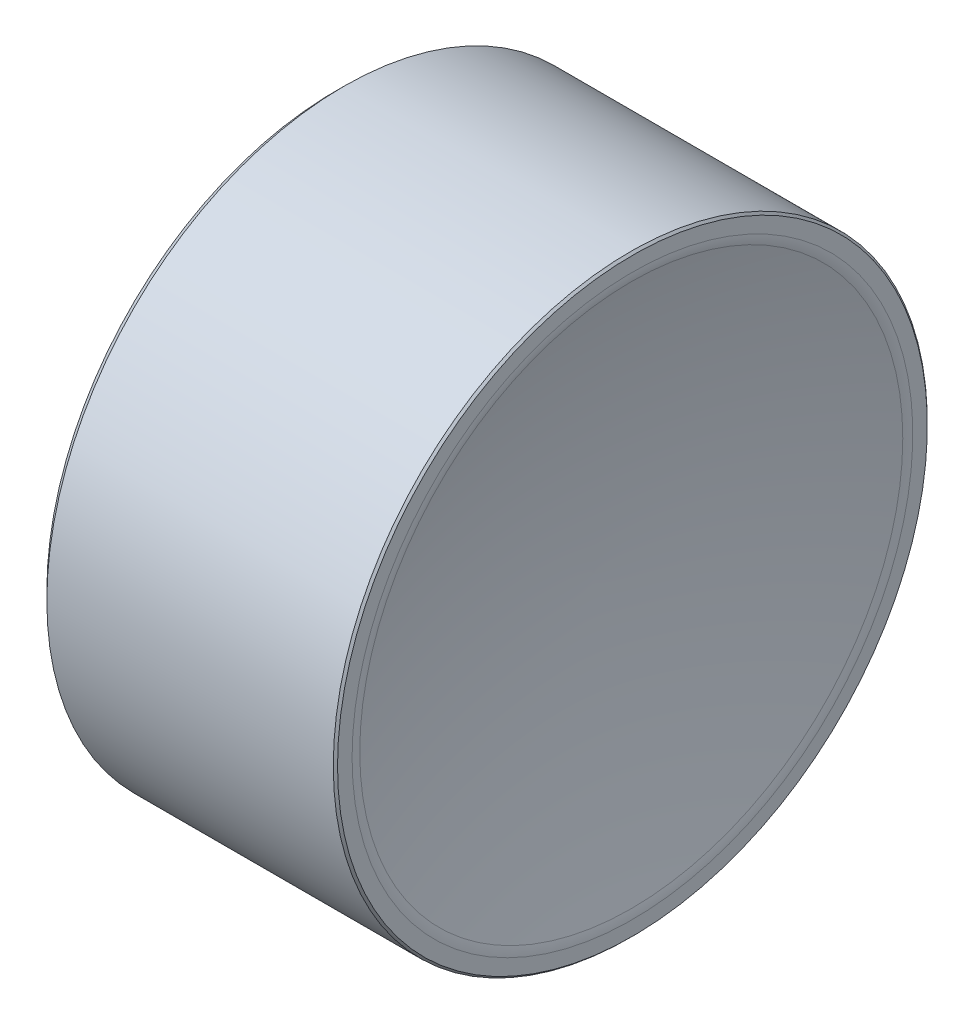
ISO-10303-21;
HEADER;
FILE_DESCRIPTION(('STEP AP214'),'2;1');
FILE_NAME('part.step','',(''),(''),'','','');
FILE_SCHEMA(('AUTOMOTIVE_DESIGN { 1 0 10303 214 1 1 1 1 }'));
ENDSEC;
DATA;
#1=APPLICATION_CONTEXT('core data for automotive mechanical design processes');
#2=APPLICATION_PROTOCOL_DEFINITION('international standard','automotive_design',2000,#1);
#3=PRODUCT_CONTEXT('',#1,'mechanical');
#4=PRODUCT('Part','Part','',(#3));
#5=PRODUCT_RELATED_PRODUCT_CATEGORY('part','',(#4));
#6=PRODUCT_DEFINITION_FORMATION('','',#4);
#7=PRODUCT_DEFINITION_CONTEXT('part definition',#1,'design');
#8=PRODUCT_DEFINITION('design','',#6,#7);
#9=PRODUCT_DEFINITION_SHAPE('','',#8);
#10=(LENGTH_UNIT() NAMED_UNIT(*) SI_UNIT(.MILLI.,.METRE.));
#11=(NAMED_UNIT(*) PLANE_ANGLE_UNIT() SI_UNIT($,.RADIAN.));
#12=(NAMED_UNIT(*) SI_UNIT($,.STERADIAN.) SOLID_ANGLE_UNIT());
#13=UNCERTAINTY_MEASURE_WITH_UNIT(LENGTH_MEASURE(1.E-05),#10,'distance_accuracy_value','');
#14=(GEOMETRIC_REPRESENTATION_CONTEXT(3) GLOBAL_UNCERTAINTY_ASSIGNED_CONTEXT((#13)) GLOBAL_UNIT_ASSIGNED_CONTEXT((#10,
#11,#12)) REPRESENTATION_CONTEXT('',''));
#15=CARTESIAN_POINT('',(0.,0.,0.));
#16=DIRECTION('',(0.,0.,1.));
#17=DIRECTION('',(1.,0.,0.));
#18=AXIS2_PLACEMENT_3D('',#15,#16,#17);
#19=CARTESIAN_POINT('',(79.9286938073556,22.225,0.));
#20=DIRECTION('',(-1.,0.,0.));
#21=DIRECTION('',(0.,1.,0.));
#22=AXIS2_PLACEMENT_3D('',#19,#20,#21);
#23=SPHERICAL_SURFACE('',#22,82.55);
#24=CARTESIAN_POINT('',(-0.199251232433501,22.225,0.));
#25=DIRECTION('',(1.,0.,0.));
#26=DIRECTION('',(0.,0.,-1.));
#27=AXIS2_PLACEMENT_3D('',#24,#25,#26);
#28=CIRCLE('',#27,19.8498091603053);
#29=CARTESIAN_POINT('',(-0.199251232433501,22.225,-19.8498091603053));
#30=VERTEX_POINT('',#29);
#31=EDGE_CURVE('E44',#30,#30,#28,.F.);
#32=ORIENTED_EDGE('',*,*,#31,.T.);
#33=EDGE_LOOP('',(#32));
#34=FACE_BOUND('',#33,.T.);
#35=ADVANCED_FACE('F37',(#34),#23,.T.);
#36=CARTESIAN_POINT('',(-2.62130619264443,22.225,0.));
#37=DIRECTION('',(-1.,0.,0.));
#38=DIRECTION('',(0.,0.,1.));
#39=AXIS2_PLACEMENT_3D('',#36,#37,#38);
#40=CYLINDRICAL_SURFACE('',#39,20.6375);
#41=CARTESIAN_POINT('',(-0.815620040431869,22.225,0.));
#42=DIRECTION('',(1.,0.,0.));
#43=DIRECTION('',(0.,0.,-1.));
#44=AXIS2_PLACEMENT_3D('',#41,#42,#43);
#45=CIRCLE('',#44,20.6375);
#46=CARTESIAN_POINT('',(-0.815620040431869,22.225,-20.6375));
#47=VERTEX_POINT('',#46);
#48=EDGE_CURVE('E11',#47,#47,#45,.T.);
#49=ORIENTED_EDGE('',*,*,#48,.T.);
#50=EDGE_LOOP('',(#49));
#51=FACE_BOUND('',#50,.T.);
#52=CARTESIAN_POINT('',(-20.47875,22.225,0.));
#53=DIRECTION('',(1.,0.,0.));
#54=DIRECTION('',(0.,0.,-1.));
#55=AXIS2_PLACEMENT_3D('',#52,#53,#54);
#56=CIRCLE('',#55,20.6375);
#57=CARTESIAN_POINT('',(-20.47875,22.225,-20.6375));
#58=VERTEX_POINT('',#57);
#59=EDGE_CURVE('E100',#58,#58,#56,.F.);
#60=ORIENTED_EDGE('',*,*,#59,.T.);
#61=EDGE_LOOP('',(#60));
#62=FACE_BOUND('',#61,.T.);
#63=ADVANCED_FACE('F66',(#51,#62),#40,.F.);
#64=CARTESIAN_POINT('',(-20.6375,42.8625,0.));
#65=DIRECTION('',(1.,0.,0.));
#66=DIRECTION('',(0.,0.,-1.));
#67=AXIS2_PLACEMENT_3D('',#64,#65,#66);
#68=PLANE('',#67);
#69=CARTESIAN_POINT('',(-20.6375,22.225,0.));
#70=DIRECTION('',(1.,0.,0.));
#71=DIRECTION('',(0.,0.,-1.));
#72=AXIS2_PLACEMENT_3D('',#69,#70,#71);
#73=CIRCLE('',#72,20.79625);
#74=CARTESIAN_POINT('',(-20.6375,22.225,-20.79625));
#75=VERTEX_POINT('',#74);
#76=EDGE_CURVE('E96',#75,#75,#73,.T.);
#77=ORIENTED_EDGE('',*,*,#76,.T.);
#78=EDGE_LOOP('',(#77));
#79=FACE_BOUND('',#78,.T.);
#80=CARTESIAN_POINT('',(-20.6375,22.225,0.));
#81=DIRECTION('',(1.,0.,0.));
#82=DIRECTION('',(0.,0.,-1.));
#83=AXIS2_PLACEMENT_3D('',#80,#81,#82);
#84=CIRCLE('',#83,21.59);
#85=CARTESIAN_POINT('',(-20.6375,22.225,-21.59));
#86=VERTEX_POINT('',#85);
#87=EDGE_CURVE('E116',#86,#86,#84,.F.);
#88=ORIENTED_EDGE('',*,*,#87,.T.);
#89=EDGE_LOOP('',(#88));
#90=FACE_BOUND('',#89,.T.);
#91=ADVANCED_FACE('F72',(#79,#90),#68,.F.);
#92=CARTESIAN_POINT('',(-2.62130619264443,22.225,0.));
#93=DIRECTION('',(-1.,0.,0.));
#94=DIRECTION('',(0.,0.,1.));
#95=AXIS2_PLACEMENT_3D('',#92,#93,#94);
#96=CYLINDRICAL_SURFACE('',#95,22.225);
#97=CARTESIAN_POINT('',(1.42875,22.225,0.));
#98=DIRECTION('',(-1.,0.,0.));
#99=DIRECTION('',(0.,0.,1.));
#100=AXIS2_PLACEMENT_3D('',#97,#98,#99);
#101=CIRCLE('',#100,22.225);
#102=CARTESIAN_POINT('',(1.42875,22.225,22.225));
#103=VERTEX_POINT('',#102);
#104=EDGE_CURVE('E110',#103,#103,#101,.T.);
#105=ORIENTED_EDGE('',*,*,#104,.T.);
#106=EDGE_LOOP('',(#105));
#107=FACE_BOUND('',#106,.T.);
#108=CARTESIAN_POINT('',(-20.0025,22.225,0.));
#109=DIRECTION('',(1.,0.,0.));
#110=DIRECTION('',(0.,0.,-1.));
#111=AXIS2_PLACEMENT_3D('',#108,#109,#110);
#112=CIRCLE('',#111,22.225);
#113=CARTESIAN_POINT('',(-20.0025,22.225,-22.225));
#114=VERTEX_POINT('',#113);
#115=EDGE_CURVE('E113',#114,#114,#112,.T.);
#116=ORIENTED_EDGE('',*,*,#115,.T.);
#117=EDGE_LOOP('',(#116));
#118=FACE_BOUND('',#117,.T.);
#119=ADVANCED_FACE('F61',(#107,#118),#96,.T.);
#120=CARTESIAN_POINT('',(1.5875,44.45,0.));
#121=DIRECTION('',(-1.,0.,0.));
#122=DIRECTION('',(0.,0.,1.));
#123=AXIS2_PLACEMENT_3D('',#120,#121,#122);
#124=PLANE('',#123);
#125=CARTESIAN_POINT('',(1.5875,22.225,0.));
#126=DIRECTION('',(-1.,0.,0.));
#127=DIRECTION('',(0.,0.,1.));
#128=AXIS2_PLACEMENT_3D('',#125,#126,#127);
#129=CIRCLE('',#128,20.9768514251902);
#130=CARTESIAN_POINT('',(1.5875,22.225,20.9768514251902));
#131=VERTEX_POINT('',#130);
#132=EDGE_CURVE('E95',#131,#131,#129,.T.);
#133=ORIENTED_EDGE('',*,*,#132,.T.);
#134=EDGE_LOOP('',(#133));
#135=FACE_BOUND('',#134,.T.);
#136=CARTESIAN_POINT('',(1.5875,22.225,0.));
#137=DIRECTION('',(-1.,0.,0.));
#138=DIRECTION('',(0.,0.,1.));
#139=AXIS2_PLACEMENT_3D('',#136,#137,#138);
#140=CIRCLE('',#139,22.06625);
#141=CARTESIAN_POINT('',(1.5875,22.225,22.06625));
#142=VERTEX_POINT('',#141);
#143=EDGE_CURVE('E107',#142,#142,#140,.F.);
#144=ORIENTED_EDGE('',*,*,#143,.T.);
#145=EDGE_LOOP('',(#144));
#146=FACE_BOUND('',#145,.T.);
#147=ADVANCED_FACE('F50',(#135,#146),#124,.F.);
#148=CARTESIAN_POINT('',(79.7195335124178,22.225,-0.793750000000003));
#149=DIRECTION('',(0.,-1.,0.));
#150=DIRECTION('',(0.,0.,1.));
#151=AXIS2_PLACEMENT_3D('',#148,#149,#150);
#152=CIRCLE('',#151,81.017980333677);
#153=TRIMMED_CURVE('',#152,(PARAMETER_VALUE(-1.5609989621194)),
(PARAMETER_VALUE(1.5609989621194)),.T.,.PARAMETER.);
#154=CARTESIAN_POINT('',(79.7195335124178,22.225,0.));
#155=DIRECTION('',(-1.,0.,0.));
#156=AXIS1_PLACEMENT('',#154,#155);
#157=SURFACE_OF_REVOLUTION('',#153,#156);
#158=CARTESIAN_POINT('',(1.499772832628,22.225,0.));
#159=DIRECTION('',(1.,0.,0.));
#160=DIRECTION('',(0.,0.,-1.));
#161=AXIS2_PLACEMENT_3D('',#158,#159,#160);
#162=CIRCLE('',#161,20.3150675070155);
#163=CARTESIAN_POINT('',(1.499772832628,22.225,-20.3150675070155));
#164=VERTEX_POINT('',#163);
#165=EDGE_CURVE('E92',#164,#164,#162,.T.);
#166=ORIENTED_EDGE('',*,*,#165,.T.);
#167=EDGE_LOOP('',(#166));
#168=FACE_BOUND('',#167,.T.);
#169=CARTESIAN_POINT('',(-1.29455846105048,22.225,0.));
#170=VERTEX_POINT('',#169);
#171=VERTEX_LOOP('',#170);
#172=FACE_BOUND('',#171,.T.);
#173=ADVANCED_FACE('F47',(#168,#172),#157,.F.);
#174=CARTESIAN_POINT('',(-20.6375,22.225,0.));
#175=DIRECTION('',(1.,0.,0.));
#176=DIRECTION('',(0.,0.,-1.));
#177=AXIS2_PLACEMENT_3D('',#174,#175,#176);
#178=CONICAL_SURFACE('',#177,21.59,0.785398163397448);
#179=ORIENTED_EDGE('',*,*,#115,.F.);
#180=EDGE_LOOP('',(#179));
#181=FACE_BOUND('',#180,.T.);
#182=ORIENTED_EDGE('',*,*,#87,.F.);
#183=EDGE_LOOP('',(#182));
#184=FACE_BOUND('',#183,.T.);
#185=ADVANCED_FACE('F49',(#181,#184),#178,.T.);
#186=CARTESIAN_POINT('',(1.42875,22.225,0.));
#187=DIRECTION('',(-1.,0.,0.));
#188=DIRECTION('',(0.,0.,1.));
#189=AXIS2_PLACEMENT_3D('',#186,#187,#188);
#190=CONICAL_SURFACE('',#189,22.225,0.785398163397448);
#191=ORIENTED_EDGE('',*,*,#143,.F.);
#192=EDGE_LOOP('',(#191));
#193=FACE_BOUND('',#192,.T.);
#194=ORIENTED_EDGE('',*,*,#104,.F.);
#195=EDGE_LOOP('',(#194));
#196=FACE_BOUND('',#195,.T.);
#197=ADVANCED_FACE('F58',(#193,#196),#190,.T.);
#198=CARTESIAN_POINT('',(-20.47875,22.225,0.));
#199=DIRECTION('',(-1.,0.,0.));
#200=DIRECTION('',(0.,0.,1.));
#201=AXIS2_PLACEMENT_3D('',#198,#199,#200);
#202=CONICAL_SURFACE('',#201,20.6375,0.785398163397437);
#203=ORIENTED_EDGE('',*,*,#76,.F.);
#204=EDGE_LOOP('',(#203));
#205=FACE_BOUND('',#204,.T.);
#206=ORIENTED_EDGE('',*,*,#59,.F.);
#207=EDGE_LOOP('',(#206));
#208=FACE_BOUND('',#207,.T.);
#209=ADVANCED_FACE('F80',(#205,#208),#202,.F.);
#210=CARTESIAN_POINT('',(-0.952500000000009,22.225,0.));
#211=DIRECTION('',(-1.,0.,0.));
#212=DIRECTION('',(0.,0.,1.));
#213=AXIS2_PLACEMENT_3D('',#210,#211,#212);
#214=TOROIDAL_SURFACE('',#213,20.9768514251902,2.54);
#215=ORIENTED_EDGE('',*,*,#165,.F.);
#216=EDGE_LOOP('',(#215));
#217=FACE_BOUND('',#216,.T.);
#218=ORIENTED_EDGE('',*,*,#132,.F.);
#219=EDGE_LOOP('',(#218));
#220=FACE_BOUND('',#219,.T.);
#221=ADVANCED_FACE('F83',(#217,#220),#214,.T.);
#222=CARTESIAN_POINT('',(-0.815620040431869,22.225,0.));
#223=DIRECTION('',(1.,0.,0.));
#224=DIRECTION('',(0.,0.,-1.));
#225=AXIS2_PLACEMENT_3D('',#222,#223,#224);
#226=TOROIDAL_SURFACE('',#225,20.0025,0.635);
#227=ORIENTED_EDGE('',*,*,#48,.F.);
#228=EDGE_LOOP('',(#227));
#229=FACE_BOUND('',#228,.T.);
#230=ORIENTED_EDGE('',*,*,#31,.F.);
#231=EDGE_LOOP('',(#230));
#232=FACE_BOUND('',#231,.T.);
#233=ADVANCED_FACE('F39',(#229,#232),#226,.F.);
#234=CLOSED_SHELL('',(#35,#63,#91,#119,#147,#173,#185,#197,#209,#221,#233));
#235=MANIFOLD_SOLID_BREP('B2',#234);
#236=ADVANCED_BREP_SHAPE_REPRESENTATION('',(#18,#235),#14);
#237=SHAPE_DEFINITION_REPRESENTATION(#9,#236);
ENDSEC;
END-ISO-10303-21;
